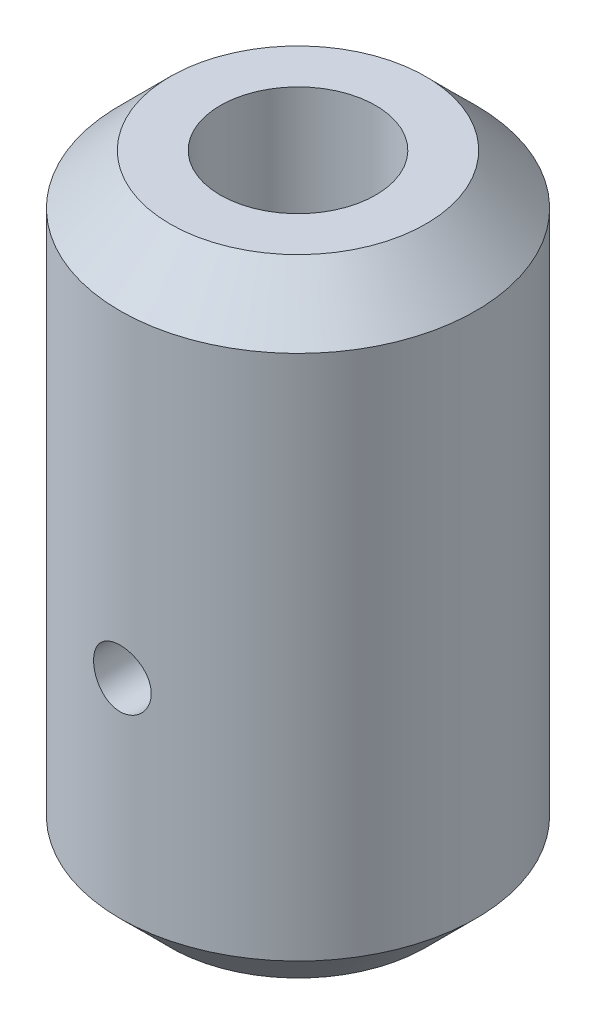
ISO-10303-21;
HEADER;
FILE_DESCRIPTION(('STEP AP214'),'2;1');
FILE_NAME('part.step','',(''),(''),'','','');
FILE_SCHEMA(('AUTOMOTIVE_DESIGN { 1 0 10303 214 1 1 1 1 }'));
ENDSEC;
DATA;
#1=APPLICATION_CONTEXT('core data for automotive mechanical design processes');
#2=APPLICATION_PROTOCOL_DEFINITION('international standard','automotive_design',2000,#1);
#3=PRODUCT_CONTEXT('',#1,'mechanical');
#4=PRODUCT('Part','Part','',(#3));
#5=PRODUCT_RELATED_PRODUCT_CATEGORY('part','',(#4));
#6=PRODUCT_DEFINITION_FORMATION('','',#4);
#7=PRODUCT_DEFINITION_CONTEXT('part definition',#1,'design');
#8=PRODUCT_DEFINITION('design','',#6,#7);
#9=PRODUCT_DEFINITION_SHAPE('','',#8);
#10=(LENGTH_UNIT() NAMED_UNIT(*) SI_UNIT(.MILLI.,.METRE.));
#11=(NAMED_UNIT(*) PLANE_ANGLE_UNIT() SI_UNIT($,.RADIAN.));
#12=(NAMED_UNIT(*) SI_UNIT($,.STERADIAN.) SOLID_ANGLE_UNIT());
#13=UNCERTAINTY_MEASURE_WITH_UNIT(LENGTH_MEASURE(1.E-05),#10,'distance_accuracy_value','');
#14=(GEOMETRIC_REPRESENTATION_CONTEXT(3) GLOBAL_UNCERTAINTY_ASSIGNED_CONTEXT((#13)) GLOBAL_UNIT_ASSIGNED_CONTEXT((#10,
#11,#12)) REPRESENTATION_CONTEXT('',''));
#15=CARTESIAN_POINT('',(0.,0.,0.));
#16=DIRECTION('',(0.,0.,1.));
#17=DIRECTION('',(1.,0.,0.));
#18=AXIS2_PLACEMENT_3D('',#15,#16,#17);
#19=CARTESIAN_POINT('',(0.,20.,0.));
#20=DIRECTION('',(0.,1.,0.));
#21=DIRECTION('',(0.,0.,1.));
#22=AXIS2_PLACEMENT_3D('',#19,#20,#21);
#23=PLANE('',#22);
#24=CARTESIAN_POINT('',(0.,20.,0.));
#25=DIRECTION('',(0.,1.,0.));
#26=DIRECTION('',(0.,0.,1.));
#27=AXIS2_PLACEMENT_3D('',#24,#25,#26);
#28=CIRCLE('',#27,5.1);
#29=CARTESIAN_POINT('',(0.,20.,5.1));
#30=VERTEX_POINT('',#29);
#31=EDGE_CURVE('E58',#30,#30,#28,.T.);
#32=ORIENTED_EDGE('',*,*,#31,.T.);
#33=EDGE_LOOP('',(#32));
#34=FACE_BOUND('',#33,.T.);
#35=CARTESIAN_POINT('',(0.,20.,0.));
#36=DIRECTION('',(0.,1.,0.));
#37=DIRECTION('',(0.,0.,1.));
#38=AXIS2_PLACEMENT_3D('',#35,#36,#37);
#39=CIRCLE('',#38,3.1);
#40=CARTESIAN_POINT('',(0.,20.,3.1));
#41=VERTEX_POINT('',#40);
#42=EDGE_CURVE('E64',#41,#41,#39,.T.);
#43=ORIENTED_EDGE('',*,*,#42,.F.);
#44=EDGE_LOOP('',(#43));
#45=FACE_BOUND('',#44,.T.);
#46=ADVANCED_FACE('F39',(#34,#45),#23,.T.);
#47=CARTESIAN_POINT('',(0.,20.,0.));
#48=DIRECTION('',(0.,-1.,0.));
#49=DIRECTION('',(0.,0.,-1.));
#50=AXIS2_PLACEMENT_3D('',#47,#48,#49);
#51=CYLINDRICAL_SURFACE('',#50,7.1);
#52=CARTESIAN_POINT('',(0.,18.,0.));
#53=DIRECTION('',(0.,1.,0.));
#54=DIRECTION('',(0.,0.,1.));
#55=AXIS2_PLACEMENT_3D('',#52,#53,#54);
#56=CIRCLE('',#55,7.1);
#57=CARTESIAN_POINT('',(0.,18.,7.1));
#58=VERTEX_POINT('',#57);
#59=EDGE_CURVE('E48',#58,#58,#56,.F.);
#60=ORIENTED_EDGE('',*,*,#59,.T.);
#61=EDGE_LOOP('',(#60));
#62=FACE_BOUND('',#61,.T.);
#63=CARTESIAN_POINT('',(0.,-2.99999999999999,0.));
#64=DIRECTION('',(0.,-1.,0.));
#65=DIRECTION('',(0.,0.,-1.));
#66=AXIS2_PLACEMENT_3D('',#63,#64,#65);
#67=CIRCLE('',#66,7.1);
#68=CARTESIAN_POINT('',(0.,-2.99999999999999,-7.1));
#69=VERTEX_POINT('',#68);
#70=EDGE_CURVE('E53',#69,#69,#67,.F.);
#71=ORIENTED_EDGE('',*,*,#70,.T.);
#72=EDGE_LOOP('',(#71));
#73=FACE_BOUND('',#72,.T.);
#74=CARTESIAN_POINT('',(0.,7.1,-7.1));
#75=CARTESIAN_POINT('',(-0.0994054449987396,7.0999972942985,-7.09999835115147));
#76=CARTESIAN_POINT('',(-0.198840847786407,7.09173778177054,-7.09789162453732));
#77=CARTESIAN_POINT('',(-0.394858806107253,7.05896929309306,-7.08969170530729));
#78=CARTESIAN_POINT('',(-0.491439764782831,7.03445139477911,-7.08359632384925));
#79=CARTESIAN_POINT('',(-0.678890109866418,6.97000568367906,-7.0680936100284));
#80=CARTESIAN_POINT('',(-0.769766303678293,6.93009665956199,-7.05869031701289));
#81=CARTESIAN_POINT('',(-0.943534246213807,6.83606840658029,-7.03757164235394));
#82=CARTESIAN_POINT('',(-1.02642567028334,6.78194860025012,-7.02585616675808));
#83=CARTESIAN_POINT('',(-1.1836228679248,6.65982706656334,-7.00110672602168));
#84=CARTESIAN_POINT('',(-1.25773585931636,6.59158139107208,-6.98805195889232));
#85=CARTESIAN_POINT('',(-1.39359642784473,6.44366748808337,-6.96223252236292));
#86=CARTESIAN_POINT('',(-1.45534256985878,6.36399793673006,-6.94946788678365));
#87=CARTESIAN_POINT('',(-1.56563021406317,6.19399228969167,-6.92546362672418));
#88=CARTESIAN_POINT('',(-1.61395480062593,6.10351141113394,-6.91425037762464));
#89=CARTESIAN_POINT('',(-1.69463217130895,5.91537979350894,-6.89492238044231));
#90=CARTESIAN_POINT('',(-1.72698758874627,5.8177302396095,-6.88680712155075));
#91=CARTESIAN_POINT('',(-1.77414805350107,5.62015619898342,-6.87480794451021));
#92=CARTESIAN_POINT('',(-1.78930033261655,5.52031979108484,-6.8708404428207));
#93=CARTESIAN_POINT('',(-1.80270618135535,5.31944927438498,-6.86733590108414));
#94=CARTESIAN_POINT('',(-1.80096258342077,5.21841536916968,-6.86779811843431));
#95=CARTESIAN_POINT('',(-1.78090292929146,5.02068909556357,-6.8730257240514));
#96=CARTESIAN_POINT('',(-1.76300194576607,4.92395132097752,-6.87768332947585));
#97=CARTESIAN_POINT('',(-1.71179834421197,4.7348988795298,-6.890604979676));
#98=CARTESIAN_POINT('',(-1.67849460127288,4.64258453626833,-6.89886928785769));
#99=CARTESIAN_POINT('',(-1.597080347068,4.4638928453995,-6.91817123282335));
#100=CARTESIAN_POINT('',(-1.54882025749591,4.37758677674036,-6.92923666906402));
#101=CARTESIAN_POINT('',(-1.43896779270745,4.2141496528171,-6.95287853601819));
#102=CARTESIAN_POINT('',(-1.3773730237876,4.13702024870973,-6.96545523783784));
#103=CARTESIAN_POINT('',(-1.24045533810502,3.99174870310683,-6.99115531410386));
#104=CARTESIAN_POINT('',(-1.16478250035857,3.92393685758061,-7.00428389842036));
#105=CARTESIAN_POINT('',(-1.00298095768751,3.80190211875248,-7.02927593474498));
#106=CARTESIAN_POINT('',(-0.916851915422113,3.74767966404807,-7.04113934591254));
#107=CARTESIAN_POINT('',(-0.736103295007426,3.65423666175967,-7.06232615380813));
#108=CARTESIAN_POINT('',(-0.641454164121274,3.61507102531999,-7.07164021835503));
#109=CARTESIAN_POINT('',(-0.44662627772682,3.55329948506739,-7.08661111997275));
#110=CARTESIAN_POINT('',(-0.346448615048982,3.53069032103857,-7.09226867703855));
#111=CARTESIAN_POINT('',(-0.146230246874536,3.50318086647057,-7.09918208017159));
#112=CARTESIAN_POINT('',(-0.0462550877914402,3.49783093324555,-7.10054966314519));
#113=CARTESIAN_POINT('',(0.153162430657396,3.50375680293913,-7.09904789525324));
#114=CARTESIAN_POINT('',(0.252604838579213,3.51503106390083,-7.09617893734285));
#115=CARTESIAN_POINT('',(0.446562827265767,3.55351501429028,-7.08659817218127));
#116=CARTESIAN_POINT('',(0.541130508046739,3.58047826945981,-7.07994582801761));
#117=CARTESIAN_POINT('',(0.724394704184835,3.64929237072173,-7.06354899965052));
#118=CARTESIAN_POINT('',(0.813090615942767,3.69114474455829,-7.05380419814699));
#119=CARTESIAN_POINT('',(0.983873886318479,3.78941271934468,-7.03203696404161));
#120=CARTESIAN_POINT('',(1.06581221910052,3.84607867279027,-7.01997642957859));
#121=CARTESIAN_POINT('',(1.21917611847021,3.97204636626107,-6.99497374166636));
#122=CARTESIAN_POINT('',(1.29059981246841,4.04135035213022,-6.98203143177753));
#123=CARTESIAN_POINT('',(1.42276863577303,4.1927168832425,-6.9563197961699));
#124=CARTESIAN_POINT('',(1.48319794921716,4.27505781431248,-6.94356312717313));
#125=CARTESIAN_POINT('',(1.58938238841568,4.44897574969605,-6.92003128674189));
#126=CARTESIAN_POINT('',(1.635138160569,4.54055234692634,-6.90925602803123));
#127=CARTESIAN_POINT('',(1.71033442208352,4.7298561355169,-6.89102705355794));
#128=CARTESIAN_POINT('',(1.73987142352538,4.82754300348023,-6.88355374226714));
#129=CARTESIAN_POINT('',(1.78204132288672,5.02671534621094,-6.87275865053008));
#130=CARTESIAN_POINT('',(1.79467804351795,5.12819995661804,-6.86943593126349));
#131=CARTESIAN_POINT('',(1.80248469083659,5.32886932743368,-6.86739122882867));
#132=CARTESIAN_POINT('',(1.79815994813522,5.42803338283928,-6.86853613702968));
#133=CARTESIAN_POINT('',(1.77332619559158,5.62416870162984,-6.87498912982488));
#134=CARTESIAN_POINT('',(1.75281752905167,5.72114001148364,-6.88029712610932));
#135=CARTESIAN_POINT('',(1.69647767952836,5.90956989550995,-6.89440296912805));
#136=CARTESIAN_POINT('',(1.66074381701597,6.0010593441385,-6.90317862492181));
#137=CARTESIAN_POINT('',(1.57504455361382,6.17681061928369,-6.9232335498707));
#138=CARTESIAN_POINT('',(1.52507712382212,6.26107141317328,-6.93451317589977));
#139=CARTESIAN_POINT('',(1.41075578308485,6.422409317249,-6.95868253353006));
#140=CARTESIAN_POINT('',(1.34605242404413,6.49923360603035,-6.97160729550035));
#141=CARTESIAN_POINT('',(1.20477352452452,6.64109845512956,-6.99740437231439));
#142=CARTESIAN_POINT('',(1.12819515624588,6.70613620069323,-7.01027667391449));
#143=CARTESIAN_POINT('',(0.963605149365806,6.82377420719362,-7.03480693398275));
#144=CARTESIAN_POINT('',(0.875405882285313,6.87611809327208,-7.04643756305313));
#145=CARTESIAN_POINT('',(0.691171657602867,6.96515246462998,-7.06688362145709));
#146=CARTESIAN_POINT('',(0.595142251841575,7.00185392791425,-7.07570102404422));
#147=CARTESIAN_POINT('',(0.416100861100472,7.05324899552777,-7.08825702246949));
#148=CARTESIAN_POINT('',(0.333925751683797,7.07074215599465,-7.0926300159088));
#149=CARTESIAN_POINT('',(0.167840787881686,7.09411833776539,-7.0985020862218));
#150=CARTESIAN_POINT('',(0.083931072310643,7.10000228450693,-7.10000139217349));
#151=CARTESIAN_POINT('',(0.,7.1,-7.1));
#152=B_SPLINE_CURVE_WITH_KNOTS('',3,(#74,#75,#76,#77,#78,#79,#80,#81,#82,#83,#84,#85,#86,#87,
#88,#89,#90,#91,#92,#93,#94,#95,#96,#97,#98,#99,#100,#101,#102,#103,#104,#105,#106,#107,#108,
#109,#110,#111,#112,#113,#114,#115,#116,#117,#118,#119,#120,#121,#122,#123,#124,#125,#126,#127,
#128,#129,#130,#131,#132,#133,#134,#135,#136,#137,#138,#139,#140,#141,#142,#143,#144,#145,#146,
#147,#148,#149,#150,#151),.UNSPECIFIED.,.T.,.F.,(4,2,2,2,2,2,2,2,2,2,2,2,2,2,2,2,2,2,2,2,2,2,2,
2,2,2,2,2,2,2,2,2,2,2,2,2,2,2,4),(0.,0.297908713414491,0.595981046553626,0.893690654759662,
1.1914123624862,1.49478395764725,1.79819073748051,2.10624829321664,2.41425503325483,
2.71592776347743,3.0175499218503,3.31163747440648,3.60574650846377,3.90289740096528,
4.20010167921148,4.50603063603014,4.81196946543218,5.1190136805725,5.4259974178656,
5.72491607073594,6.02380699951461,6.31812520898399,6.6124736266001,6.91216033947532,
7.21190036022406,7.51922234767709,7.82653079511974,8.13199017583507,8.43738045232818,
8.7337424046811,9.03009807060881,9.32458717841963,9.61911828475083,9.92153726589956,
10.22402837308,10.532197434223,10.8401498617555,11.0917033979316,11.3432368805077),.UNSPECIFIED.);
#153=CARTESIAN_POINT('',(0.,7.1,-7.1));
#154=VERTEX_POINT('',#153);
#155=EDGE_CURVE('E65',#154,#154,#152,.T.);
#156=ORIENTED_EDGE('',*,*,#155,.T.);
#157=EDGE_LOOP('',(#156));
#158=FACE_BOUND('',#157,.T.);
#159=CARTESIAN_POINT('',(1.15,5.3,7.00624721230988));
#160=CARTESIAN_POINT('',(1.14999740025826,5.23586021910871,7.00624834761014));
#161=CARTESIAN_POINT('',(1.14461586397533,5.17168476672744,7.00713752033711));
#162=CARTESIAN_POINT('',(1.12324019807608,5.04513264903693,7.01059513921914));
#163=CARTESIAN_POINT('',(1.10723611671592,4.98275772779216,7.01316516004563));
#164=CARTESIAN_POINT('',(1.06511059904821,4.86165657153903,7.01968593127844));
#165=CARTESIAN_POINT('',(1.03899741610719,4.80292740529929,7.02363555508014));
#166=CARTESIAN_POINT('',(0.97741519226911,4.69069101830318,7.03246917540618));
#167=CARTESIAN_POINT('',(0.941947272618005,4.63718317277871,7.03735305993206));
#168=CARTESIAN_POINT('',(0.862309812178144,4.5364029141259,7.04755575791847));
#169=CARTESIAN_POINT('',(0.818070198127128,4.48918619879577,7.05287785762208));
#170=CARTESIAN_POINT('',(0.722296553607188,4.40281196567108,7.06332808704208));
#171=CARTESIAN_POINT('',(0.670762100411369,4.36365491524706,7.06845620549566));
#172=CARTESIAN_POINT('',(0.561501911059201,4.29430349611692,7.07797533917705));
#173=CARTESIAN_POINT('',(0.503742962817328,4.26416080943621,7.08236204357673));
#174=CARTESIAN_POINT('',(0.383898807362697,4.21402579445299,7.08986756538978));
#175=CARTESIAN_POINT('',(0.321813866262287,4.19403284241793,7.09298646071159));
#176=CARTESIAN_POINT('',(0.195655035879941,4.16493474871412,7.09758175458296));
#177=CARTESIAN_POINT('',(0.131603233621318,4.15573610819469,7.09907225020812));
#178=CARTESIAN_POINT('',(0.00284915435668602,4.14819713418825,7.10029120579119));
#179=CARTESIAN_POINT('',(-0.0618530805173527,4.1498561018641,7.10001977915316));
#180=CARTESIAN_POINT('',(-0.189432490351323,4.16391208228915,7.09775666233275));
#181=CARTESIAN_POINT('',(-0.252321077039713,4.17620848184993,7.09578109114738));
#182=CARTESIAN_POINT('',(-0.375130340093165,4.21103199231789,7.09034962585115));
#183=CARTESIAN_POINT('',(-0.435050929988866,4.23355940110021,7.0868936886397));
#184=CARTESIAN_POINT('',(-0.550524042063361,4.28830632663266,7.07886227669044));
#185=CARTESIAN_POINT('',(-0.606056436845534,4.32056756312278,7.07428199904068));
#186=CARTESIAN_POINT('',(-0.71095739929013,4.3938358322109,7.06451125064662));
#187=CARTESIAN_POINT('',(-0.760325494719811,4.43484353420451,7.05932073321233));
#188=CARTESIAN_POINT('',(-0.852090536828684,4.5249994396594,7.04883701039384));
#189=CARTESIAN_POINT('',(-0.894401103262963,4.57423555413806,7.04354330989933));
#190=CARTESIAN_POINT('',(-0.970173800914077,4.67915372753485,7.03350753286501));
#191=CARTESIAN_POINT('',(-1.00363585904532,4.73483583968919,7.02876546088164));
#192=CARTESIAN_POINT('',(-1.06077709907003,4.85116261112841,7.02036971349023));
#193=CARTESIAN_POINT('',(-1.08444632566675,4.91181224570319,7.01671714670966));
#194=CARTESIAN_POINT('',(-1.12123740690355,5.03629875146901,7.01093266642323));
#195=CARTESIAN_POINT('',(-1.13436013561175,5.10013535806571,7.00880062690142));
#196=CARTESIAN_POINT('',(-1.14956500716232,5.22841211443922,7.00632284491943));
#197=CARTESIAN_POINT('',(-1.1517700853299,5.29283732099068,7.0059572134293));
#198=CARTESIAN_POINT('',(-1.14540425654601,5.42113654902234,7.00700072033856));
#199=CARTESIAN_POINT('',(-1.1368337417469,5.48501059047573,7.00840979415172));
#200=CARTESIAN_POINT('',(-1.10926466877788,5.61000665035727,7.012825599699));
#201=CARTESIAN_POINT('',(-1.09032829778251,5.67114275115278,7.01582280048979));
#202=CARTESIAN_POINT('',(-1.04263011171528,5.78937361906945,7.02306919382852));
#203=CARTESIAN_POINT('',(-1.01386773840338,5.84646815635664,7.02731845750744));
#204=CARTESIAN_POINT('',(-0.947042339725836,5.95554348060836,7.03663659351802));
#205=CARTESIAN_POINT('',(-0.908900300566846,6.00747526543813,7.04171229813041));
#206=CARTESIAN_POINT('',(-0.824507136691664,6.10424516391539,7.0520912572622));
#207=CARTESIAN_POINT('',(-0.778255474468777,6.14908280698744,7.05739452684702));
#208=CARTESIAN_POINT('',(-0.678412266301461,6.23083839307182,7.06769376443172));
#209=CARTESIAN_POINT('',(-0.624753292417155,6.26767450011101,7.072686215443));
#210=CARTESIAN_POINT('',(-0.511937313117889,6.33180905003776,7.08174540397796));
#211=CARTESIAN_POINT('',(-0.452780477872296,6.35910778800083,7.08581217013995));
#212=CARTESIAN_POINT('',(-0.330894741349973,6.40326434176202,7.09254645290588));
#213=CARTESIAN_POINT('',(-0.268181891315961,6.42016554052874,7.09521977631062));
#214=CARTESIAN_POINT('',(-0.140761311153611,6.44318716226976,7.09889046201912));
#215=CARTESIAN_POINT('',(-0.0760537360666512,6.44930842098335,7.09988795424521));
#216=CARTESIAN_POINT('',(0.0527285036490678,6.45057341777854,7.10009290704533));
#217=CARTESIAN_POINT('',(0.116801945294622,6.44584187318467,7.09932070453465));
#218=CARTESIAN_POINT('',(0.243228885103046,6.42580462245776,7.09611439979809));
#219=CARTESIAN_POINT('',(0.305582391618806,6.41049896768746,7.09368030564469));
#220=CARTESIAN_POINT('',(0.42675573353341,6.36979479086313,7.08742264396752));
#221=CARTESIAN_POINT('',(0.485579015215016,6.34440630264777,7.08360045811292));
#222=CARTESIAN_POINT('',(0.598150202372552,6.28427084835408,7.0749846048365));
#223=CARTESIAN_POINT('',(0.651897888885323,6.24952347877884,7.07019089553081));
#224=CARTESIAN_POINT('',(0.75342174201574,6.17121187105474,7.06009845488425));
#225=CARTESIAN_POINT('',(0.80112680259749,6.12755607428606,7.0547948090709));
#226=CARTESIAN_POINT('',(0.888578523954166,6.03285922603729,7.04431494693952));
#227=CARTESIAN_POINT('',(0.928323317747809,5.98181644685678,7.03913876076463));
#228=CARTESIAN_POINT('',(0.998967288647257,5.87339314345668,7.02946284092105));
#229=CARTESIAN_POINT('',(1.02980598637527,5.81597279180525,7.02496782648897));
#230=CARTESIAN_POINT('',(1.081353493067,5.6967186486661,7.01721881496057));
#231=CARTESIAN_POINT('',(1.10207253698998,5.6348893891781,7.01396356471113));
#232=CARTESIAN_POINT('',(1.1282334691014,5.52734020735063,7.0097934385154));
#233=CARTESIAN_POINT('',(1.13638300157102,5.48227547400463,7.00847089675397));
#234=CARTESIAN_POINT('',(1.14726714942048,5.3914798691017,7.00669738596752));
#235=CARTESIAN_POINT('',(1.15000185431888,5.34574900856984,7.00624640253379));
#236=CARTESIAN_POINT('',(1.15,5.3,7.00624721230988));
#237=B_SPLINE_CURVE_WITH_KNOTS('',3,(#159,#160,#161,#162,#163,#164,#165,#166,#167,#168,#169,
#170,#171,#172,#173,#174,#175,#176,#177,#178,#179,#180,#181,#182,#183,#184,#185,#186,#187,#188,
#189,#190,#191,#192,#193,#194,#195,#196,#197,#198,#199,#200,#201,#202,#203,#204,#205,#206,#207,
#208,#209,#210,#211,#212,#213,#214,#215,#216,#217,#218,#219,#220,#221,#222,#223,#224,#225,#226,
#227,#228,#229,#230,#231,#232,#233,#234,#235,#236),.UNSPECIFIED.,.T.,.F.,(4,2,2,2,2,2,2,2,2,2,2,
2,2,2,2,2,2,2,2,2,2,2,2,2,2,2,2,2,2,2,2,2,2,2,2,2,2,2,4),(0.,0.19225207008241,0.38468450644571,
0.576960165542512,0.769212789206414,0.963068058595129,1.15693456625904,1.35189215003582,
1.54683775161612,1.74008199627611,1.93331380312088,2.12473768255573,2.31616713564102,
2.5084290114268,2.70070560692625,2.8951858651839,3.08966772973052,3.28434681971054,
3.47900977349643,3.67147571109239,3.86393464454578,4.05525142840628,4.24657908326504,
4.43957727133662,4.63258825618794,4.82748892138762,5.02238355604525,5.21645939189449,
5.41052018091213,5.6023620676822,5.79420302260526,5.98585354523135,6.17751233196249,
6.37125028714355,6.56503362807222,6.76010352811467,6.95497572493014,7.09210570711619,
7.22923342223384),.UNSPECIFIED.);
#238=CARTESIAN_POINT('',(1.15,5.3,7.00624721230988));
#239=VERTEX_POINT('',#238);
#240=EDGE_CURVE('E110',#239,#239,#237,.T.);
#241=ORIENTED_EDGE('',*,*,#240,.T.);
#242=EDGE_LOOP('',(#241));
#243=FACE_BOUND('',#242,.T.);
#244=ADVANCED_FACE('F77',(#62,#73,#158,#243),#51,.T.);
#245=CARTESIAN_POINT('',(0.,20.,0.));
#246=DIRECTION('',(0.,-1.,0.));
#247=DIRECTION('',(0.,0.,-1.));
#248=AXIS2_PLACEMENT_3D('',#245,#246,#247);
#249=CYLINDRICAL_SURFACE('',#248,3.1);
#250=CARTESIAN_POINT('',(0.,6.45,-3.1));
#251=CARTESIAN_POINT('',(-0.0623274751839224,6.45000200183407,-3.10000148778647));
#252=CARTESIAN_POINT('',(-0.124641095029814,6.44491706773997,-3.09810384057055));
#253=CARTESIAN_POINT('',(-0.24740866647371,6.42479193899234,-3.09072310606397));
#254=CARTESIAN_POINT('',(-0.30786284084649,6.40975294180622,-3.08524045004853));
#255=CARTESIAN_POINT('',(-0.425123440302188,6.37032300103643,-3.07127894863526));
#256=CARTESIAN_POINT('',(-0.481936570029557,6.34594985886183,-3.06280580887007));
#257=CARTESIAN_POINT('',(-0.590664250934487,6.28863301733493,-3.0437093578578));
#258=CARTESIAN_POINT('',(-0.642577513679591,6.25568707225097,-3.03308548336633));
#259=CARTESIAN_POINT('',(-0.74219650065869,6.18072416455404,-3.01029143981665));
#260=CARTESIAN_POINT('',(-0.789670727095004,6.13841278945586,-2.99807815877364));
#261=CARTESIAN_POINT('',(-0.877035119975752,6.0465451343717,-2.97369642018703));
#262=CARTESIAN_POINT('',(-0.916923036606454,5.99698671286834,-2.96152797698654));
#263=CARTESIAN_POINT('',(-0.989439016368296,5.8897879895624,-2.9381148856784));
#264=CARTESIAN_POINT('',(-1.02174272869257,5.83191601611742,-2.92692127846115));
#265=CARTESIAN_POINT('',(-1.07605591098386,5.71107967352657,-2.90739452268332));
#266=CARTESIAN_POINT('',(-1.09806939258448,5.64811730011413,-2.89906025974863));
#267=CARTESIAN_POINT('',(-1.13026786785498,5.52154956213338,-2.88665605684527));
#268=CARTESIAN_POINT('',(-1.14089393014335,5.45807244199499,-2.88242775293408));
#269=CARTESIAN_POINT('',(-1.15139506708335,5.33010607988528,-2.87825025842878));
#270=CARTESIAN_POINT('',(-1.15127446070818,5.26561725492567,-2.87829934879468));
#271=CARTESIAN_POINT('',(-1.14062347336312,5.14146446604231,-2.88253432201608));
#272=CARTESIAN_POINT('',(-1.13070108274708,5.08173858193522,-2.88647858857974));
#273=CARTESIAN_POINT('',(-1.10173194739203,4.96486936323597,-2.8976585791296));
#274=CARTESIAN_POINT('',(-1.08268385845011,4.90772641046349,-2.90489478800649));
#275=CARTESIAN_POINT('',(-1.03566387237303,4.79639179258627,-2.92199142709829));
#276=CARTESIAN_POINT('',(-1.00753206967615,4.74227510766708,-2.93189831133175));
#277=CARTESIAN_POINT('',(-0.9432546135094,4.63935248683171,-2.95320417844871));
#278=CARTESIAN_POINT('',(-0.907106235319518,4.59054836500851,-2.96460366810671));
#279=CARTESIAN_POINT('',(-0.825026303632884,4.49626542552796,-2.98852355844187));
#280=CARTESIAN_POINT('',(-0.778608241993259,4.45121533220105,-3.00106841307022));
#281=CARTESIAN_POINT('',(-0.678730505667638,4.36941293185859,-3.02522097375166));
#282=CARTESIAN_POINT('',(-0.625269796389357,4.33266184615664,-3.0368285417088));
#283=CARTESIAN_POINT('',(-0.511749605317333,4.26804134358233,-3.05802071479034));
#284=CARTESIAN_POINT('',(-0.451603953856062,4.24031185862899,-3.0675727346904));
#285=CARTESIAN_POINT('',(-0.327059157886474,4.1955061336832,-3.08333644743386));
#286=CARTESIAN_POINT('',(-0.262661873937311,4.17842526747044,-3.08954959066749));
#287=CARTESIAN_POINT('',(-0.135052197541682,4.15621925032059,-3.09768202650239));
#288=CARTESIAN_POINT('',(-0.0719534081583641,4.15051658654545,-3.09980851650616));
#289=CARTESIAN_POINT('',(0.0543278746047959,4.14955094891689,-3.10016643036532));
#290=CARTESIAN_POINT('',(0.117510346946882,4.15428571906272,-3.09839869593849));
#291=CARTESIAN_POINT('',(0.239688609544965,4.17361959409813,-3.09130355392399));
#292=CARTESIAN_POINT('',(0.29875258596243,4.18784279845382,-3.08611187778309));
#293=CARTESIAN_POINT('',(0.413616181722524,4.22525740063176,-3.07282721429552));
#294=CARTESIAN_POINT('',(0.469415375223791,4.24844996538194,-3.06473384944457));
#295=CARTESIAN_POINT('',(0.577986517971424,4.30388004465511,-3.04615413139571));
#296=CARTESIAN_POINT('',(0.630622878993442,4.33636142673969,-3.03560492104914));
#297=CARTESIAN_POINT('',(0.729872614035568,4.40917045127858,-3.01328357326419));
#298=CARTESIAN_POINT('',(0.776483788416832,4.44950094585193,-3.00151099201843));
#299=CARTESIAN_POINT('',(0.865125726038008,4.53955826046598,-2.97721168328625));
#300=CARTESIAN_POINT('',(0.906746399528634,4.58968845326647,-2.964680074529));
#301=CARTESIAN_POINT('',(0.981062646954497,4.69647099173041,-2.94092548331999));
#302=CARTESIAN_POINT('',(1.01375750975134,4.75312385655813,-2.92970260517837));
#303=CARTESIAN_POINT('',(1.06930410756236,4.87175854474945,-2.90989107432086));
#304=CARTESIAN_POINT('',(1.09212208466613,4.93375778908771,-2.90131148436677));
#305=CARTESIAN_POINT('',(1.1268489477391,5.06112440078511,-2.88800346207178));
#306=CARTESIAN_POINT('',(1.13876438658825,5.12648972000279,-2.88327271660468));
#307=CARTESIAN_POINT('',(1.15076920904284,5.25430014993092,-2.87850099191677));
#308=CARTESIAN_POINT('',(1.15155595662937,5.31666999701156,-2.87818348645021));
#309=CARTESIAN_POINT('',(1.14306061232484,5.44060301927539,-2.88156779303683));
#310=CARTESIAN_POINT('',(1.13377943350609,5.5021662670976,-2.88526924060635));
#311=CARTESIAN_POINT('',(1.10595011916268,5.62091558322165,-2.89604652866703));
#312=CARTESIAN_POINT('',(1.0876807041544,5.6781769907377,-2.90302060332557));
#313=CARTESIAN_POINT('',(1.04263679039989,5.7888566726779,-2.91950010274391));
#314=CARTESIAN_POINT('',(1.01586016382596,5.84227398151011,-2.92900616070828));
#315=CARTESIAN_POINT('',(0.952957575735904,5.94674499598881,-2.95008893556448));
#316=CARTESIAN_POINT('',(0.916420478840614,5.9975345080525,-2.9617471886808));
#317=CARTESIAN_POINT('',(0.835676319537217,6.09248455577053,-2.98553427497949));
#318=CARTESIAN_POINT('',(0.791466846206936,6.13664299955696,-2.99766325514743));
#319=CARTESIAN_POINT('',(0.693857427480825,6.21943850871005,-3.02179003346864));
#320=CARTESIAN_POINT('',(0.640096848366749,6.25766402060328,-3.03374751829667));
#321=CARTESIAN_POINT('',(0.526496575541484,6.32452158706883,-3.0555102183255));
#322=CARTESIAN_POINT('',(0.466656628654518,6.35315324189058,-3.06531534383733));
#323=CARTESIAN_POINT('',(0.340392594165833,6.4006054429387,-3.08193409408479));
#324=CARTESIAN_POINT('',(0.273813100980023,6.41905592261471,-3.08863361806726));
#325=CARTESIAN_POINT('',(0.138149265123785,6.44374919799875,-3.09766471122641));
#326=CARTESIAN_POINT('',(0.0690661259179849,6.44999778173392,-3.09999835135873));
#327=CARTESIAN_POINT('',(0.,6.45,-3.1));
#328=B_SPLINE_CURVE_WITH_KNOTS('',3,(#250,#251,#252,#253,#254,#255,#256,#257,#258,#259,#260,
#261,#262,#263,#264,#265,#266,#267,#268,#269,#270,#271,#272,#273,#274,#275,#276,#277,#278,#279,
#280,#281,#282,#283,#284,#285,#286,#287,#288,#289,#290,#291,#292,#293,#294,#295,#296,#297,#298,
#299,#300,#301,#302,#303,#304,#305,#306,#307,#308,#309,#310,#311,#312,#313,#314,#315,#316,#317,
#318,#319,#320,#321,#322,#323,#324,#325,#326,#327),.UNSPECIFIED.,.T.,.F.,(4,2,2,2,2,2,2,2,2,2,2,
2,2,2,2,2,2,2,2,2,2,2,2,2,2,2,2,2,2,2,2,2,2,2,2,2,2,2,4),(0.,0.186727732149383,
0.373433005154149,0.559783966352816,0.746183793285387,0.939589988984082,1.13305345254331,
1.33369645720805,1.5342611760783,1.72674049493776,1.91914245873069,2.1003146416364,
2.28151351916625,2.46609400374563,2.65073732102032,2.84750391621148,3.04429944948102,
3.2440161077705,3.44364593993534,3.63285573995175,3.82202464719709,4.00411212831746,
4.1862233072798,4.37364100361521,4.56112692918993,4.75925338792411,4.95739562721262,
5.15620984380394,5.3549044861185,5.54108877716578,5.72725618434781,5.90798348206171,
6.08875601900532,6.2788565305967,6.46901688676934,6.66916008871437,6.86931162905901,
7.07632599888447,7.28324214658582),.UNSPECIFIED.);
#329=CARTESIAN_POINT('',(0.,6.45,-3.1));
#330=VERTEX_POINT('',#329);
#331=EDGE_CURVE('E104',#330,#330,#328,.T.);
#332=ORIENTED_EDGE('',*,*,#331,.F.);
#333=EDGE_LOOP('',(#332));
#334=FACE_BOUND('',#333,.T.);
#335=CARTESIAN_POINT('',(1.15,5.3,2.87880183409696));
#336=CARTESIAN_POINT('',(1.1500020931633,5.23783969296449,2.87879990620993));
#337=CARTESIAN_POINT('',(1.14494333623463,5.17569335884757,2.88083699611195));
#338=CARTESIAN_POINT('',(1.12493169473864,5.05327113903162,2.88870955115821));
#339=CARTESIAN_POINT('',(1.10997893632416,4.99299522949411,2.89454496787212));
#340=CARTESIAN_POINT('',(1.07080070860115,4.87611480043508,2.90926414042618));
#341=CARTESIAN_POINT('',(1.04659703225715,4.81950201521144,2.9181407269386));
#342=CARTESIAN_POINT('',(0.989680986856344,4.71111880494302,2.93793063773845));
#343=CARTESIAN_POINT('',(0.95696612161803,4.65934980656168,2.9488445592746));
#344=CARTESIAN_POINT('',(0.882252761205398,4.55960669586681,2.97207398933659));
#345=CARTESIAN_POINT('',(0.839907820728558,4.51190148422507,2.9844301276322));
#346=CARTESIAN_POINT('',(0.747871828336445,4.42408055120432,3.00881238249315));
#347=CARTESIAN_POINT('',(0.698179255890252,4.38396640465934,3.02083843013679));
#348=CARTESIAN_POINT('',(0.590825068111561,4.31117869664552,3.04368716873497));
#349=CARTESIAN_POINT('',(0.532953661389063,4.27879636137223,3.05445665595461));
#350=CARTESIAN_POINT('',(0.412114728599999,4.22433794408495,3.07309144620705));
#351=CARTESIAN_POINT('',(0.349148937781499,4.2022583699439,3.08095773309205));
#352=CARTESIAN_POINT('',(0.222734884958558,4.16997215265015,3.0926114498265));
#353=CARTESIAN_POINT('',(0.159419690705569,4.15930279961271,3.09655733741652));
#354=CARTESIAN_POINT('',(0.0317827592961787,4.14865845180097,3.10049370531841));
#355=CARTESIAN_POINT('',(-0.0325386510205641,4.14868005366174,3.10048544439631));
#356=CARTESIAN_POINT('',(-0.15704982359324,4.15914509563927,3.0966159115862));
#357=CARTESIAN_POINT('',(-0.217288815096004,4.16908374126434,3.09294126564429));
#358=CARTESIAN_POINT('',(-0.335173930923562,4.19825306998109,3.08239556038385));
#359=CARTESIAN_POINT('',(-0.392819871805677,4.21748440934823,3.0755242753112));
#360=CARTESIAN_POINT('',(-0.504870073066908,4.26493358227129,3.05914389098936));
#361=CARTESIAN_POINT('',(-0.55921548766363,4.29327719821961,3.04959812652872));
#362=CARTESIAN_POINT('',(-0.662512495646668,4.35803587553779,3.02883758816577));
#363=CARTESIAN_POINT('',(-0.711462362366407,4.39445350956716,3.01762228266543));
#364=CARTESIAN_POINT('',(-0.805555940219208,4.47677017379589,2.9939218581729));
#365=CARTESIAN_POINT('',(-0.850320134766692,4.52309331668343,2.9814008031921));
#366=CARTESIAN_POINT('',(-0.931585815452962,4.62266764345503,2.9570174362826));
#367=CARTESIAN_POINT('',(-0.968085316870047,4.67592048664485,2.94515528310068));
#368=CARTESIAN_POINT('',(-1.03248937876447,4.78930963471215,2.92320918958237));
#369=CARTESIAN_POINT('',(-1.06019416084498,4.84956846372589,2.91316853992481));
#370=CARTESIAN_POINT('',(-1.10492089352021,4.97436658585498,2.89650243273066));
#371=CARTESIAN_POINT('',(-1.12194863590758,5.03890353724402,2.88987512396605));
#372=CARTESIAN_POINT('',(-1.14398393065089,5.16668222784113,2.88122095256277));
#373=CARTESIAN_POINT('',(-1.14959298813093,5.22980456317662,2.87896420210487));
#374=CARTESIAN_POINT('',(-1.15036391245374,5.35611507715009,2.87865668284786));
#375=CARTESIAN_POINT('',(-1.14552831046277,5.41930323612707,2.88060489501501));
#376=CARTESIAN_POINT('',(-1.12609212650973,5.54090321859219,2.88825472625521));
#377=CARTESIAN_POINT('',(-1.11195155610437,5.59940098719985,2.89377933880398));
#378=CARTESIAN_POINT('',(-1.07488286914008,5.71316844611998,2.90775107995702));
#379=CARTESIAN_POINT('',(-1.05195297562014,5.76843748106513,2.91619879950005));
#380=CARTESIAN_POINT('',(-0.997002028520505,5.87644925114916,2.93544919516165));
#381=CARTESIAN_POINT('',(-0.964676324948633,5.92902314671162,2.94632736209359));
#382=CARTESIAN_POINT('',(-0.892177546724102,6.02821437895482,2.96908417876716));
#383=CARTESIAN_POINT('',(-0.852001653536572,6.07482956624536,2.98096318697728));
#384=CARTESIAN_POINT('',(-0.762004063128215,6.16376731139024,3.00527042493947));
#385=CARTESIAN_POINT('',(-0.711739711509235,6.20564658219362,3.01768723072775));
#386=CARTESIAN_POINT('',(-0.604591615548341,6.28042654402467,3.04096541135929));
#387=CARTESIAN_POINT('',(-0.547707882757037,6.31332725071931,3.05182678891665));
#388=CARTESIAN_POINT('',(-0.42900276052802,6.36898790320878,3.07075733931425));
#389=CARTESIAN_POINT('',(-0.367201393197486,6.39178671391212,3.07883718624779));
#390=CARTESIAN_POINT('',(-0.240273540050408,6.4265401803343,3.09133090011404));
#391=CARTESIAN_POINT('',(-0.175148593752783,6.43849980957842,3.09574644832048));
#392=CARTESIAN_POINT('',(-0.0474334365840545,6.45070775422125,3.1002579875836));
#393=CARTESIAN_POINT('',(0.015088850707786,6.45158647319225,3.10058647994376));
#394=CARTESIAN_POINT('',(0.139351475877437,6.44322249179382,3.09748968818277));
#395=CARTESIAN_POINT('',(0.20109190383505,6.43398096833233,3.09406484054673));
#396=CARTESIAN_POINT('',(0.320569406545779,6.40607963009001,3.08395031573329));
#397=CARTESIAN_POINT('',(0.378366423737581,6.38764588987801,3.07733912862879));
#398=CARTESIAN_POINT('',(0.490053896635449,6.34210671264006,3.06154074874107));
#399=CARTESIAN_POINT('',(0.543943611330743,6.31499963598507,3.05235306893188));
#400=CARTESIAN_POINT('',(0.648742058943431,6.25159822706812,3.03184825774388));
#401=CARTESIAN_POINT('',(0.699433401952245,6.214968502417,3.02045841876428));
#402=CARTESIAN_POINT('',(0.79414586778139,6.13409438007357,2.99695140341604));
#403=CARTESIAN_POINT('',(0.838164620562215,6.08984728862847,2.98483397073675));
#404=CARTESIAN_POINT('',(0.920607410324851,5.99229001492124,2.9604772761328));
#405=CARTESIAN_POINT('',(0.958627818676796,5.93863099394931,2.94826373980307));
#406=CARTESIAN_POINT('',(1.02512302580335,5.82529880933179,2.92580917327704));
#407=CARTESIAN_POINT('',(1.05359722403538,5.76562526762572,2.91556826719419));
#408=CARTESIAN_POINT('',(1.1008132220236,5.63968249922016,2.89808091790039));
#409=CARTESIAN_POINT('',(1.11918344581598,5.57325634348107,2.89095057942538));
#410=CARTESIAN_POINT('',(1.14377190357598,5.43788000190154,2.88131354111161));
#411=CARTESIAN_POINT('',(1.14999767882909,5.36893140952683,2.8788039719881));
#412=CARTESIAN_POINT('',(1.15,5.3,2.87880183409696));
#413=B_SPLINE_CURVE_WITH_KNOTS('',3,(#335,#336,#337,#338,#339,#340,#341,#342,#343,#344,#345,
#346,#347,#348,#349,#350,#351,#352,#353,#354,#355,#356,#357,#358,#359,#360,#361,#362,#363,#364,
#365,#366,#367,#368,#369,#370,#371,#372,#373,#374,#375,#376,#377,#378,#379,#380,#381,#382,#383,
#384,#385,#386,#387,#388,#389,#390,#391,#392,#393,#394,#395,#396,#397,#398,#399,#400,#401,#402,
#403,#404,#405,#406,#407,#408,#409,#410,#411,#412),.UNSPECIFIED.,.T.,.F.,(4,2,2,2,2,2,2,2,2,2,2,
2,2,2,2,2,2,2,2,2,2,2,2,2,2,2,2,2,2,2,2,2,2,2,2,2,2,2,4),(0.,0.186224379442447,0.37244638448868,
0.558232372004895,0.744072908817565,0.938128234957566,1.13222377557259,1.33276296837573,
1.53323413883547,1.72522554579099,1.91715583412725,2.09979067716935,2.28243842026942,
2.46772419062899,2.65306908446683,2.84904815735227,3.04507424376461,3.24527851884827,
3.44537409834858,3.63462386414173,3.82382777215679,4.00431736074018,4.18484345865004,
4.37204092014011,4.55930571698598,4.75814288158262,4.95697969921989,5.15504474726745,
5.35301886769396,5.53967563603123,5.72631069989767,5.90856663866999,6.09085705193351,
6.28073371758973,6.47067766836358,6.67038031668378,6.87009552574251,7.07673362371833,
7.28324336563279),.UNSPECIFIED.);
#414=CARTESIAN_POINT('',(1.15,5.3,2.87880183409696));
#415=VERTEX_POINT('',#414);
#416=EDGE_CURVE('E74',#415,#415,#413,.T.);
#417=ORIENTED_EDGE('',*,*,#416,.F.);
#418=EDGE_LOOP('',(#417));
#419=FACE_BOUND('',#418,.T.);
#420=ORIENTED_EDGE('',*,*,#42,.T.);
#421=EDGE_LOOP('',(#420));
#422=FACE_BOUND('',#421,.T.);
#423=CARTESIAN_POINT('',(0.,0.,0.));
#424=DIRECTION('',(0.,1.,0.));
#425=DIRECTION('',(0.,0.,1.));
#426=AXIS2_PLACEMENT_3D('',#423,#424,#425);
#427=CIRCLE('',#426,3.1);
#428=CARTESIAN_POINT('',(0.,0.,3.1));
#429=VERTEX_POINT('',#428);
#430=EDGE_CURVE('E116',#429,#429,#427,.T.);
#431=ORIENTED_EDGE('',*,*,#430,.F.);
#432=EDGE_LOOP('',(#431));
#433=FACE_BOUND('',#432,.T.);
#434=ADVANCED_FACE('F94',(#334,#419,#422,#433),#249,.F.);
#435=CARTESIAN_POINT('',(0.,5.3,-7.1));
#436=DIRECTION('',(0.,0.,1.));
#437=DIRECTION('',(1.,0.,0.));
#438=AXIS2_PLACEMENT_3D('',#435,#436,#437);
#439=CYLINDRICAL_SURFACE('',#438,1.15);
#440=ORIENTED_EDGE('',*,*,#416,.T.);
#441=EDGE_LOOP('',(#440));
#442=FACE_BOUND('',#441,.T.);
#443=ORIENTED_EDGE('',*,*,#240,.F.);
#444=EDGE_LOOP('',(#443));
#445=FACE_BOUND('',#444,.T.);
#446=ADVANCED_FACE('F92',(#442,#445),#439,.F.);
#447=CARTESIAN_POINT('',(0.,5.3,-4.));
#448=DIRECTION('',(0.,0.,1.));
#449=DIRECTION('',(1.,0.,0.));
#450=AXIS2_PLACEMENT_3D('',#447,#448,#449);
#451=CIRCLE('',#450,1.15);
#452=CARTESIAN_POINT('',(1.15,5.3,-4.));
#453=VERTEX_POINT('',#452);
#454=EDGE_CURVE('E75',#453,#453,#451,.F.);
#455=ORIENTED_EDGE('',*,*,#454,.T.);
#456=EDGE_LOOP('',(#455));
#457=FACE_BOUND('',#456,.T.);
#458=ORIENTED_EDGE('',*,*,#331,.T.);
#459=EDGE_LOOP('',(#458));
#460=FACE_BOUND('',#459,.T.);
#461=ADVANCED_FACE('F86',(#457,#460),#439,.F.);
#462=CARTESIAN_POINT('',(0.,5.3,-9.));
#463=DIRECTION('',(0.,0.,1.));
#464=DIRECTION('',(1.,0.,0.));
#465=AXIS2_PLACEMENT_3D('',#462,#463,#464);
#466=CYLINDRICAL_SURFACE('',#465,1.8);
#467=CARTESIAN_POINT('',(0.,5.3,-4.));
#468=DIRECTION('',(0.,0.,1.));
#469=DIRECTION('',(1.,0.,0.));
#470=AXIS2_PLACEMENT_3D('',#467,#468,#469);
#471=CIRCLE('',#470,1.8);
#472=CARTESIAN_POINT('',(1.8,5.3,-4.));
#473=VERTEX_POINT('',#472);
#474=EDGE_CURVE('E138',#473,#473,#471,.T.);
#475=ORIENTED_EDGE('',*,*,#474,.T.);
#476=EDGE_LOOP('',(#475));
#477=FACE_BOUND('',#476,.T.);
#478=ORIENTED_EDGE('',*,*,#155,.F.);
#479=EDGE_LOOP('',(#478));
#480=FACE_BOUND('',#479,.T.);
#481=ADVANCED_FACE('F80',(#477,#480),#466,.F.);
#482=CARTESIAN_POINT('',(0.,5.3,-4.));
#483=DIRECTION('',(0.,0.,1.));
#484=DIRECTION('',(1.,0.,0.));
#485=AXIS2_PLACEMENT_3D('',#482,#483,#484);
#486=PLANE('',#485);
#487=ORIENTED_EDGE('',*,*,#474,.F.);
#488=EDGE_LOOP('',(#487));
#489=FACE_BOUND('',#488,.T.);
#490=ORIENTED_EDGE('',*,*,#454,.F.);
#491=EDGE_LOOP('',(#490));
#492=FACE_BOUND('',#491,.T.);
#493=ADVANCED_FACE('F85',(#489,#492),#486,.F.);
#494=CARTESIAN_POINT('',(0.,0.,0.));
#495=DIRECTION('',(0.,-1.,0.));
#496=DIRECTION('',(0.,0.,-1.));
#497=AXIS2_PLACEMENT_3D('',#494,#495,#496);
#498=PLANE('',#497);
#499=ORIENTED_EDGE('',*,*,#430,.T.);
#500=EDGE_LOOP('',(#499));
#501=FACE_BOUND('',#500,.T.);
#502=ADVANCED_FACE('F147',(#501),#498,.F.);
#503=CARTESIAN_POINT('',(0.,-5.,0.));
#504=DIRECTION('',(0.,-1.,0.));
#505=DIRECTION('',(0.,0.,-1.));
#506=AXIS2_PLACEMENT_3D('',#503,#504,#505);
#507=PLANE('',#506);
#508=CARTESIAN_POINT('',(0.,-5.,0.));
#509=DIRECTION('',(0.,-1.,0.));
#510=DIRECTION('',(0.,0.,-1.));
#511=AXIS2_PLACEMENT_3D('',#508,#509,#510);
#512=CIRCLE('',#511,5.1);
#513=CARTESIAN_POINT('',(0.,-5.,-5.1));
#514=VERTEX_POINT('',#513);
#515=EDGE_CURVE('E10',#514,#514,#512,.T.);
#516=ORIENTED_EDGE('',*,*,#515,.T.);
#517=EDGE_LOOP('',(#516));
#518=FACE_BOUND('',#517,.T.);
#519=ADVANCED_FACE('F152',(#518),#507,.T.);
#520=CARTESIAN_POINT('',(0.,20.,0.));
#521=DIRECTION('',(0.,-1.,0.));
#522=DIRECTION('',(0.,0.,-1.));
#523=AXIS2_PLACEMENT_3D('',#520,#521,#522);
#524=CONICAL_SURFACE('',#523,5.1,0.785398163397446);
#525=ORIENTED_EDGE('',*,*,#59,.F.);
#526=EDGE_LOOP('',(#525));
#527=FACE_BOUND('',#526,.T.);
#528=ORIENTED_EDGE('',*,*,#31,.F.);
#529=EDGE_LOOP('',(#528));
#530=FACE_BOUND('',#529,.T.);
#531=ADVANCED_FACE('F161',(#527,#530),#524,.T.);
#532=CARTESIAN_POINT('',(0.,-5.,0.));
#533=DIRECTION('',(0.,1.,0.));
#534=DIRECTION('',(0.,0.,1.));
#535=AXIS2_PLACEMENT_3D('',#532,#533,#534);
#536=CONICAL_SURFACE('',#535,5.1,0.785398163397445);
#537=ORIENTED_EDGE('',*,*,#70,.F.);
#538=EDGE_LOOP('',(#537));
#539=FACE_BOUND('',#538,.T.);
#540=ORIENTED_EDGE('',*,*,#515,.F.);
#541=EDGE_LOOP('',(#540));
#542=FACE_BOUND('',#541,.T.);
#543=ADVANCED_FACE('F42',(#539,#542),#536,.T.);
#544=CLOSED_SHELL('',(#46,#244,#434,#446,#461,#481,#493,#502,#519,#531,#543));
#545=MANIFOLD_SOLID_BREP('B2',#544);
#546=ADVANCED_BREP_SHAPE_REPRESENTATION('',(#18,#545),#14);
#547=SHAPE_DEFINITION_REPRESENTATION(#9,#546);
ENDSEC;
END-ISO-10303-21;
